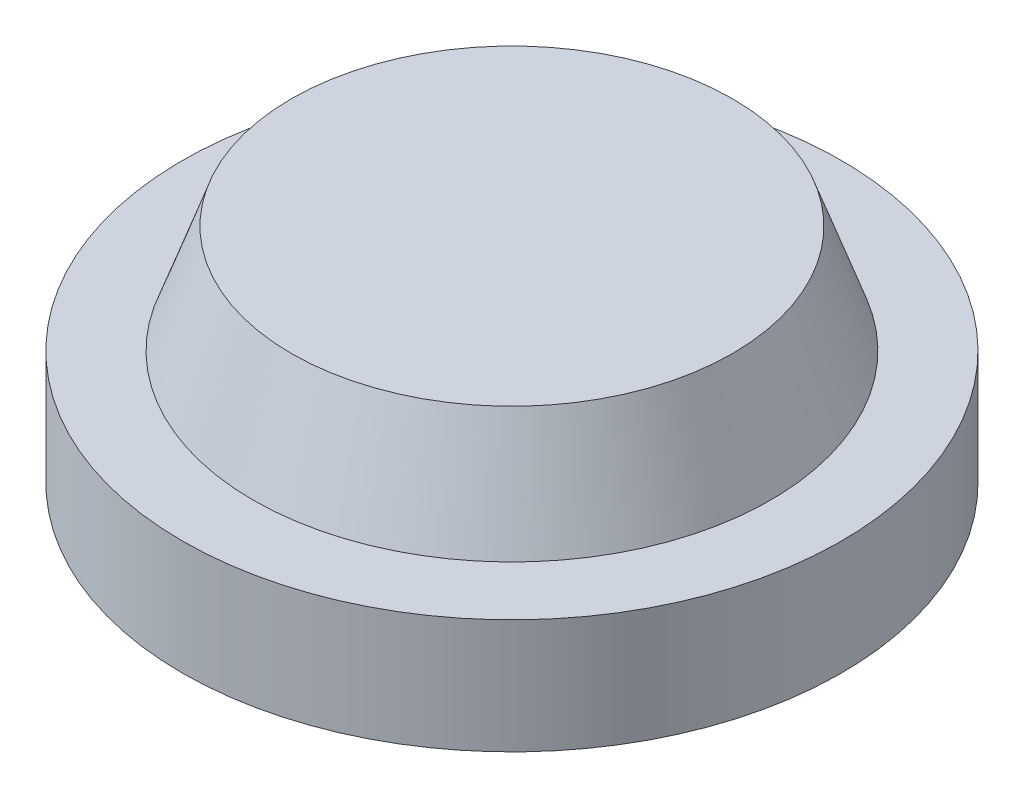
ISO-10303-21;
HEADER;
FILE_DESCRIPTION(('STEP AP214'),'2;1');
FILE_NAME('part.step','',(''),(''),'','','');
FILE_SCHEMA(('AUTOMOTIVE_DESIGN { 1 0 10303 214 1 1 1 1 }'));
ENDSEC;
DATA;
#1=APPLICATION_CONTEXT('core data for automotive mechanical design processes');
#2=APPLICATION_PROTOCOL_DEFINITION('international standard','automotive_design',2000,#1);
#3=PRODUCT_CONTEXT('',#1,'mechanical');
#4=PRODUCT('Part','Part','',(#3));
#5=PRODUCT_RELATED_PRODUCT_CATEGORY('part','',(#4));
#6=PRODUCT_DEFINITION_FORMATION('','',#4);
#7=PRODUCT_DEFINITION_CONTEXT('part definition',#1,'design');
#8=PRODUCT_DEFINITION('design','',#6,#7);
#9=PRODUCT_DEFINITION_SHAPE('','',#8);
#10=(LENGTH_UNIT() NAMED_UNIT(*) SI_UNIT(.MILLI.,.METRE.));
#11=(NAMED_UNIT(*) PLANE_ANGLE_UNIT() SI_UNIT($,.RADIAN.));
#12=(NAMED_UNIT(*) SI_UNIT($,.STERADIAN.) SOLID_ANGLE_UNIT());
#13=UNCERTAINTY_MEASURE_WITH_UNIT(LENGTH_MEASURE(1.E-05),#10,'distance_accuracy_value','');
#14=(GEOMETRIC_REPRESENTATION_CONTEXT(3) GLOBAL_UNCERTAINTY_ASSIGNED_CONTEXT((#13)) GLOBAL_UNIT_ASSIGNED_CONTEXT((#10,
#11,#12)) REPRESENTATION_CONTEXT('',''));
#15=CARTESIAN_POINT('',(0.,0.,0.));
#16=DIRECTION('',(0.,0.,1.));
#17=DIRECTION('',(1.,0.,0.));
#18=AXIS2_PLACEMENT_3D('',#15,#16,#17);
#19=CARTESIAN_POINT('',(0.,0.,0.));
#20=DIRECTION('',(0.,1.,0.));
#21=DIRECTION('',(0.,0.,1.));
#22=AXIS2_PLACEMENT_3D('',#19,#20,#21);
#23=PLANE('',#22);
#24=CARTESIAN_POINT('',(0.,0.,0.));
#25=DIRECTION('',(0.,1.,0.));
#26=DIRECTION('',(0.,0.,1.));
#27=AXIS2_PLACEMENT_3D('',#24,#25,#26);
#28=CIRCLE('',#27,30.25);
#29=CARTESIAN_POINT('',(0.,0.,30.25));
#30=VERTEX_POINT('',#29);
#31=EDGE_CURVE('E10',#30,#30,#28,.T.);
#32=ORIENTED_EDGE('',*,*,#31,.F.);
#33=EDGE_LOOP('',(#32));
#34=FACE_BOUND('',#33,.T.);
#35=ADVANCED_FACE('F37',(#34),#23,.F.);
#36=CARTESIAN_POINT('',(0.,20.4048672566372,0.));
#37=DIRECTION('',(0.,1.,0.));
#38=DIRECTION('',(0.,0.,1.));
#39=AXIS2_PLACEMENT_3D('',#36,#37,#38);
#40=CYLINDRICAL_SURFACE('',#39,30.25);
#41=CARTESIAN_POINT('',(0.,10.5,0.));
#42=DIRECTION('',(0.,1.,0.));
#43=DIRECTION('',(0.,0.,1.));
#44=AXIS2_PLACEMENT_3D('',#41,#42,#43);
#45=CIRCLE('',#44,30.25);
#46=CARTESIAN_POINT('',(0.,10.5,30.25));
#47=VERTEX_POINT('',#46);
#48=EDGE_CURVE('E44',#47,#47,#45,.T.);
#49=ORIENTED_EDGE('',*,*,#48,.F.);
#50=EDGE_LOOP('',(#49));
#51=FACE_BOUND('',#50,.T.);
#52=ORIENTED_EDGE('',*,*,#31,.T.);
#53=EDGE_LOOP('',(#52));
#54=FACE_BOUND('',#53,.T.);
#55=ADVANCED_FACE('F71',(#51,#54),#40,.T.);
#56=CARTESIAN_POINT('',(30.25,10.5,0.));
#57=DIRECTION('',(0.,-1.,0.));
#58=DIRECTION('',(0.,0.,-1.));
#59=AXIS2_PLACEMENT_3D('',#56,#57,#58);
#60=PLANE('',#59);
#61=CARTESIAN_POINT('',(0.,10.5,0.));
#62=DIRECTION('',(0.,1.,0.));
#63=DIRECTION('',(0.,0.,1.));
#64=AXIS2_PLACEMENT_3D('',#61,#62,#63);
#65=CIRCLE('',#64,23.75);
#66=CARTESIAN_POINT('',(0.,10.5,23.75));
#67=VERTEX_POINT('',#66);
#68=EDGE_CURVE('E49',#67,#67,#65,.T.);
#69=ORIENTED_EDGE('',*,*,#68,.F.);
#70=EDGE_LOOP('',(#69));
#71=FACE_BOUND('',#70,.T.);
#72=ORIENTED_EDGE('',*,*,#48,.T.);
#73=EDGE_LOOP('',(#72));
#74=FACE_BOUND('',#73,.T.);
#75=ADVANCED_FACE('F66',(#71,#74),#60,.F.);
#76=CARTESIAN_POINT('',(0.,10.5,0.));
#77=DIRECTION('',(0.,-1.,0.));
#78=DIRECTION('',(0.,0.,-1.));
#79=AXIS2_PLACEMENT_3D('',#76,#77,#78);
#80=CONICAL_SURFACE('',#79,23.75,0.33966644184519);
#81=CARTESIAN_POINT('',(0.,20.4048672566372,0.));
#82=DIRECTION('',(0.,1.,0.));
#83=DIRECTION('',(0.,0.,1.));
#84=AXIS2_PLACEMENT_3D('',#81,#82,#83);
#85=CIRCLE('',#84,20.25);
#86=CARTESIAN_POINT('',(0.,20.4048672566372,20.25));
#87=VERTEX_POINT('',#86);
#88=EDGE_CURVE('E54',#87,#87,#85,.T.);
#89=ORIENTED_EDGE('',*,*,#88,.F.);
#90=EDGE_LOOP('',(#89));
#91=FACE_BOUND('',#90,.T.);
#92=ORIENTED_EDGE('',*,*,#68,.T.);
#93=EDGE_LOOP('',(#92));
#94=FACE_BOUND('',#93,.T.);
#95=ADVANCED_FACE('F63',(#91,#94),#80,.T.);
#96=CARTESIAN_POINT('',(20.25,20.4048672566372,0.));
#97=DIRECTION('',(0.,-1.,0.));
#98=DIRECTION('',(0.,0.,-1.));
#99=AXIS2_PLACEMENT_3D('',#96,#97,#98);
#100=PLANE('',#99);
#101=ORIENTED_EDGE('',*,*,#88,.T.);
#102=EDGE_LOOP('',(#101));
#103=FACE_BOUND('',#102,.T.);
#104=ADVANCED_FACE('F61',(#103),#100,.F.);
#105=CLOSED_SHELL('',(#35,#55,#75,#95,#104));
#106=MANIFOLD_SOLID_BREP('B2',#105);
#107=ADVANCED_BREP_SHAPE_REPRESENTATION('',(#18,#106),#14);
#108=SHAPE_DEFINITION_REPRESENTATION(#9,#107);
ENDSEC;
END-ISO-10303-21;
